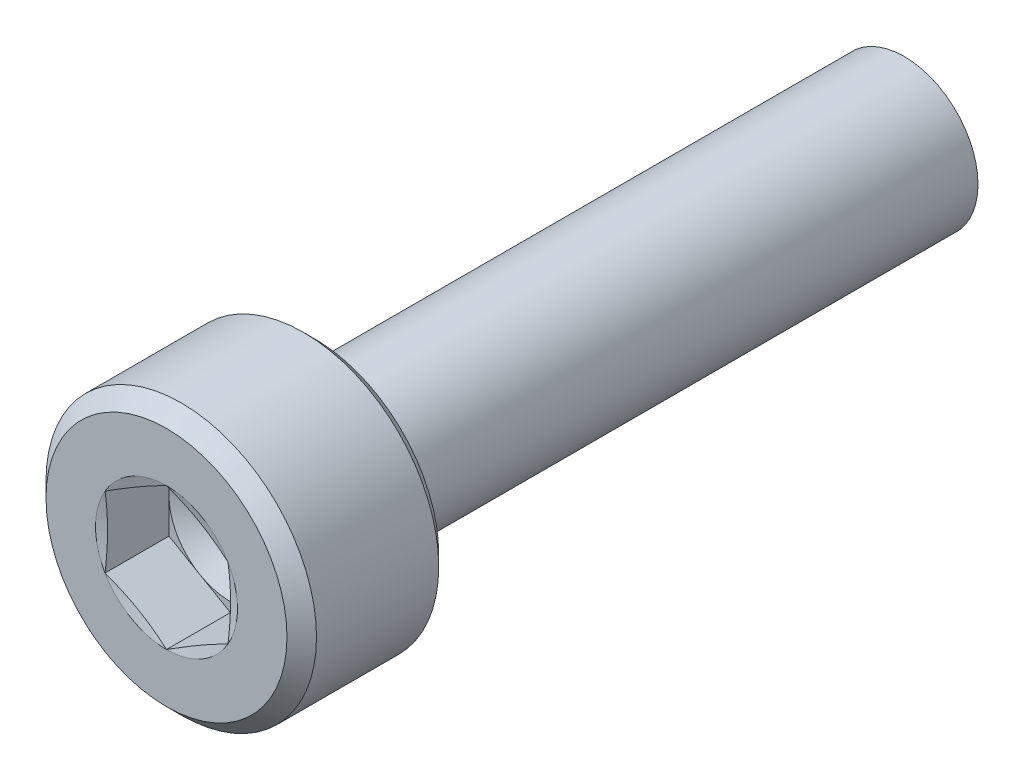
ISO-10303-21;
HEADER;
FILE_DESCRIPTION(('STEP AP214'),'2;1');
FILE_NAME('part.step','',(''),(''),'','','');
FILE_SCHEMA(('AUTOMOTIVE_DESIGN { 1 0 10303 214 1 1 1 1 }'));
ENDSEC;
DATA;
#1=APPLICATION_CONTEXT('core data for automotive mechanical design processes');
#2=APPLICATION_PROTOCOL_DEFINITION('international standard','automotive_design',2000,#1);
#3=PRODUCT_CONTEXT('',#1,'mechanical');
#4=PRODUCT('Part','Part','',(#3));
#5=PRODUCT_RELATED_PRODUCT_CATEGORY('part','',(#4));
#6=PRODUCT_DEFINITION_FORMATION('','',#4);
#7=PRODUCT_DEFINITION_CONTEXT('part definition',#1,'design');
#8=PRODUCT_DEFINITION('design','',#6,#7);
#9=PRODUCT_DEFINITION_SHAPE('','',#8);
#10=(LENGTH_UNIT() NAMED_UNIT(*) SI_UNIT(.MILLI.,.METRE.));
#11=(NAMED_UNIT(*) PLANE_ANGLE_UNIT() SI_UNIT($,.RADIAN.));
#12=(NAMED_UNIT(*) SI_UNIT($,.STERADIAN.) SOLID_ANGLE_UNIT());
#13=UNCERTAINTY_MEASURE_WITH_UNIT(LENGTH_MEASURE(1.E-05),#10,'distance_accuracy_value','');
#14=(GEOMETRIC_REPRESENTATION_CONTEXT(3) GLOBAL_UNCERTAINTY_ASSIGNED_CONTEXT((#13)) GLOBAL_UNIT_ASSIGNED_CONTEXT((#10,
#11,#12)) REPRESENTATION_CONTEXT('',''));
#15=CARTESIAN_POINT('',(0.,0.,0.));
#16=DIRECTION('',(0.,0.,1.));
#17=DIRECTION('',(1.,0.,0.));
#18=AXIS2_PLACEMENT_3D('',#15,#16,#17);
#19=CARTESIAN_POINT('',(1.25,0.721687836487033,-1.3));
#20=DIRECTION('',(0.5,0.866025403784439,0.));
#21=DIRECTION('',(0.,0.,-1.));
#22=AXIS2_PLACEMENT_3D('',#19,#20,#21);
#23=PLANE('',#22);
#24=CARTESIAN_POINT('',(0.,1.44337567297407,0.));
#25=CARTESIAN_POINT('',(0.0266010741574035,1.42801550344856,-0.00411563079121512));
#26=CARTESIAN_POINT('',(0.0532235716252887,1.41263958063488,-0.00803870308418439));
#27=CARTESIAN_POINT('',(0.105990950310015,1.38216656964672,-0.0153837682666469));
#28=CARTESIAN_POINT('',(0.132134938423043,1.36706993862756,-0.0188140917976724));
#29=CARTESIAN_POINT('',(0.184080896535333,1.33708618540438,-0.025174957981675));
#30=CARTESIAN_POINT('',(0.209882172940569,1.32219928511393,-0.0281121725270214));
#31=CARTESIAN_POINT('',(0.261290419336476,1.29254695927157,-0.0334872092687405));
#32=CARTESIAN_POINT('',(0.286897013202713,1.27778166527025,-0.0359293451582305));
#33=CARTESIAN_POINT('',(0.338814014231531,1.24779551622449,-0.0403875802559015));
#34=CARTESIAN_POINT('',(0.365124701320746,1.23257315304511,-0.0423903504078004));
#35=CARTESIAN_POINT('',(0.41739626342825,1.20233457949772,-0.0458161323987716));
#36=CARTESIAN_POINT('',(0.443356722749427,1.18731855544823,-0.0472470738867774));
#37=CARTESIAN_POINT('',(0.495189289691946,1.15738161600266,-0.0495320426407517));
#38=CARTESIAN_POINT('',(0.521061212339776,1.14246059341946,-0.0503888439825338));
#39=CARTESIAN_POINT('',(0.572960169546127,1.112545265764,-0.0515316995489692));
#40=CARTESIAN_POINT('',(0.598987292307348,1.09755099650677,-0.0518146703940937));
#41=CARTESIAN_POINT('',(0.651001958011103,1.06751871961563,-0.0518150403478976));
#42=CARTESIAN_POINT('',(0.676989512865152,1.0524807326171,-0.0515326731292534));
#43=CARTESIAN_POINT('',(0.728831950621195,1.02250093089559,-0.0503906133892446));
#44=CARTESIAN_POINT('',(0.754686839083206,1.00755901473306,-0.049533851076964));
#45=CARTESIAN_POINT('',(0.806530383134818,0.977641594560691,-0.0472488111413174));
#46=CARTESIAN_POINT('',(0.832519038985485,0.962666316501925,-0.0458176006639986));
#47=CARTESIAN_POINT('',(0.88485675257379,0.932508881624223,-0.0423912966395548));
#48=CARTESIAN_POINT('',(0.911205415535616,0.917326964095512,-0.0403881252485901));
#49=CARTESIAN_POINT('',(0.963136866609753,0.88735267068188,-0.035930182334875));
#50=CARTESIAN_POINT('',(0.988721142724691,0.872560833289737,-0.0334890493531678));
#51=CARTESIAN_POINT('',(1.04009703212967,0.842869124815658,-0.028115294806166));
#52=CARTESIAN_POINT('',(1.0658883492984,0.827969535565703,-0.0251782943883381));
#53=CARTESIAN_POINT('',(1.11782834522753,0.797976194945342,-0.0188173828427319));
#54=CARTESIAN_POINT('',(1.14397648287602,0.782882943312323,-0.0153867360503964));
#55=CARTESIAN_POINT('',(1.19675851906724,0.752418637222199,-0.0080404922123379));
#56=CARTESIAN_POINT('',(1.22339156591776,0.737048126643099,-0.00411650230644957));
#57=CARTESIAN_POINT('',(1.25,0.721687836487034,0.));
#58=B_SPLINE_CURVE_WITH_KNOTS('',3,(#24,#25,#26,#27,#28,#29,#30,#31,#32,#33,#34,#35,#36,#37,#38,
#39,#40,#41,#42,#43,#44,#45,#46,#47,#48,#49,#50,#51,#52,#53,#54,#55,#56,#57),.UNSPECIFIED.,.F.,
.F.,(4,2,2,2,2,2,2,2,2,2,2,2,2,2,2,2,4),(0.,0.0929756429984322,0.184124524266457,
0.273918330281164,0.362892504558264,0.454276274812247,0.544344744756976,0.633974830661911,
0.724085265734565,0.814158462912087,0.903775623702066,0.993856267691678,1.0852780295682,
1.17423384973417,1.26402077718908,1.35517544424662,1.44817056877235),.UNSPECIFIED.);
#59=CARTESIAN_POINT('',(0.,1.44337567297406,0.));
#60=VERTEX_POINT('',#59);
#61=CARTESIAN_POINT('',(1.25,0.721687836487034,0.));
#62=VERTEX_POINT('',#61);
#63=EDGE_CURVE('E258',#60,#62,#58,.T.);
#64=ORIENTED_EDGE('',*,*,#63,.F.);
#65=DIRECTION('',(0.,0.,1.));
#66=VECTOR('',#65,1.);
#67=CARTESIAN_POINT('',(0.,1.44337567297406,-1.3));
#68=LINE('',#67,#66);
#69=CARTESIAN_POINT('',(0.,1.44337567297406,-1.3));
#70=VERTEX_POINT('',#69);
#71=EDGE_CURVE('E362',#70,#60,#68,.T.);
#72=ORIENTED_EDGE('',*,*,#71,.F.);
#73=DIRECTION('',(-0.866025403784439,0.5,0.));
#74=VECTOR('',#73,1.);
#75=CARTESIAN_POINT('',(1.25,0.721687836487033,-1.3));
#76=LINE('',#75,#74);
#77=CARTESIAN_POINT('',(0.625,1.08253175473055,-1.3));
#78=VERTEX_POINT('',#77);
#79=EDGE_CURVE('E217',#78,#70,#76,.T.);
#80=ORIENTED_EDGE('',*,*,#79,.F.);
#81=DIRECTION('',(-0.866025403784439,0.5,0.));
#82=VECTOR('',#81,1.);
#83=CARTESIAN_POINT('',(1.25,0.721687836487033,-1.3));
#84=LINE('',#83,#82);
#85=CARTESIAN_POINT('',(1.25,0.721687836487033,-1.3));
#86=VERTEX_POINT('',#85);
#87=EDGE_CURVE('E233',#86,#78,#84,.T.);
#88=ORIENTED_EDGE('',*,*,#87,.F.);
#89=DIRECTION('',(0.,0.,1.));
#90=VECTOR('',#89,1.);
#91=CARTESIAN_POINT('',(1.25,0.721687836487033,-1.3));
#92=LINE('',#91,#90);
#93=EDGE_CURVE('E11',#86,#62,#92,.T.);
#94=ORIENTED_EDGE('',*,*,#93,.T.);
#95=EDGE_LOOP('',(#64,#72,#80,#88,#94));
#96=FACE_BOUND('',#95,.T.);
#97=ADVANCED_FACE('F40',(#96),#23,.F.);
#98=CARTESIAN_POINT('',(1.25,-0.721687836487033,-1.3));
#99=DIRECTION('',(1.,0.,0.));
#100=DIRECTION('',(0.,-1.,0.));
#101=AXIS2_PLACEMENT_3D('',#98,#99,#100);
#102=PLANE('',#101);
#103=CARTESIAN_POINT('',(1.25,0.721687836487034,0.));
#104=CARTESIAN_POINT('',(1.24999823698251,0.690999940764968,-0.0041116921545435));
#105=CARTESIAN_POINT('',(1.24999343638009,0.660285670486277,-0.0080312219209347));
#106=CARTESIAN_POINT('',(1.24998639785537,0.599409952891843,-0.0153701172192225));
#107=CARTESIAN_POINT('',(1.24998411141551,0.569249506080653,-0.0187977996777385));
#108=CARTESIAN_POINT('',(1.24998996305486,0.509329780508077,-0.0251543025812117));
#109=CARTESIAN_POINT('',(1.24999794646817,0.479571212976206,-0.0280897892747288));
#110=CARTESIAN_POINT('',(1.2500223367559,0.420283812845672,-0.0334622466755174));
#111=CARTESIAN_POINT('',(1.25003866580902,0.39075537251126,-0.0359035370987912));
#112=CARTESIAN_POINT('',(1.25002873622066,0.330797047066719,-0.0403659968356117));
#113=CARTESIAN_POINT('',(1.25000121650915,0.300366084889518,-0.0423727707061422));
#114=CARTESIAN_POINT('',(1.2499487716613,0.239913774778711,-0.0458055537624093));
#115=CARTESIAN_POINT('',(1.24992381469335,0.209892884574225,-0.0472395610352221));
#116=CARTESIAN_POINT('',(1.24991464001477,0.149977872401545,-0.0495283234961986));
#117=CARTESIAN_POINT('',(1.24993022107687,0.120083859273445,-0.0503859133498061));
#118=CARTESIAN_POINT('',(1.24996835071472,0.0601265989330451,-0.0515327901252948));
#119=CARTESIAN_POINT('',(1.24999093574578,0.030063293747345,-0.0518190439098863));
#120=CARTESIAN_POINT('',(1.25,0.,-0.0518148554092244));
#121=B_SPLINE_CURVE_WITH_KNOTS('',3,(#103,#104,#105,#106,#107,#108,#109,#110,#111,#112,#113,
#114,#115,#116,#117,#118,#119,#120),.UNSPECIFIED.,.F.,.F.,(4,2,2,2,2,2,2,2,4),(0.,
0.0928866686125054,0.18394754574854,0.273652950549812,0.362536731833363,0.454023240761691,
0.544183383798673,0.633896834523419,0.72408530693755),.UNSPECIFIED.);
#122=CARTESIAN_POINT('',(1.25,0.,-0.0518148554092244));
#123=VERTEX_POINT('',#122);
#124=EDGE_CURVE('E264',#62,#123,#121,.T.);
#125=ORIENTED_EDGE('',*,*,#124,.F.);
#126=ORIENTED_EDGE('',*,*,#93,.F.);
#127=DIRECTION('',(0.,1.,0.));
#128=VECTOR('',#127,1.);
#129=CARTESIAN_POINT('',(1.25,-0.721687836487033,-1.3));
#130=LINE('',#129,#128);
#131=CARTESIAN_POINT('',(1.25,0.,-1.3));
#132=VERTEX_POINT('',#131);
#133=EDGE_CURVE('E237',#132,#86,#130,.T.);
#134=ORIENTED_EDGE('',*,*,#133,.F.);
#135=DIRECTION('',(0.,1.,0.));
#136=VECTOR('',#135,1.);
#137=CARTESIAN_POINT('',(1.25,-0.721687836487033,-1.3));
#138=LINE('',#137,#136);
#139=CARTESIAN_POINT('',(1.25,-0.721687836487033,-1.3));
#140=VERTEX_POINT('',#139);
#141=EDGE_CURVE('E209',#140,#132,#138,.T.);
#142=ORIENTED_EDGE('',*,*,#141,.F.);
#143=DIRECTION('',(0.,0.,1.));
#144=VECTOR('',#143,1.);
#145=CARTESIAN_POINT('',(1.25,-0.721687836487033,-1.3));
#146=LINE('',#145,#144);
#147=CARTESIAN_POINT('',(1.25,-0.721687836487031,0.));
#148=VERTEX_POINT('',#147);
#149=EDGE_CURVE('E54',#140,#148,#146,.T.);
#150=ORIENTED_EDGE('',*,*,#149,.T.);
#151=CARTESIAN_POINT('',(1.25,0.,-0.0518148554092244));
#152=CARTESIAN_POINT('',(1.24999097697891,-0.0300388242332713,-0.0518190278008075));
#153=CARTESIAN_POINT('',(1.24996934760271,-0.0600776555269679,-0.0515329955368294));
#154=CARTESIAN_POINT('',(1.24993379974361,-0.119991561939784,-0.05038720494537));
#155=CARTESIAN_POINT('',(1.24991984260544,-0.149866692950213,-0.0495303717689572));
#156=CARTESIAN_POINT('',(1.24993183671915,-0.209749120653996,-0.0472437357421163));
#157=CARTESIAN_POINT('',(1.24995799405163,-0.239756304838218,-0.0458110022567921));
#158=CARTESIAN_POINT('',(1.25001075989497,-0.300186021092445,-0.0423815066628743));
#159=CARTESIAN_POINT('',(1.25003736932907,-0.330608091422305,-0.040376671117203));
#160=CARTESIAN_POINT('',(1.2500446486428,-0.39057222202749,-0.0359167393057105));
#161=CARTESIAN_POINT('',(1.25002656990743,-0.420115329127233,-0.0334756444191961));
#162=CARTESIAN_POINT('',(1.24999981108288,-0.479432961970562,-0.0281026849191924));
#163=CARTESIAN_POINT('',(1.24999121968782,-0.509207093749055,-0.0251664799491732));
#164=CARTESIAN_POINT('',(1.24998452367544,-0.569159340782016,-0.0188078031597437));
#165=CARTESIAN_POINT('',(1.24998657991599,-0.599336742030467,-0.0153786379059865));
#166=CARTESIAN_POINT('',(1.24999338873797,-0.660248180215888,-0.00803601627135115));
#167=CARTESIAN_POINT('',(1.24999819468793,-0.690981212849153,-0.0041142106816611));
#168=CARTESIAN_POINT('',(1.25,-0.72168783648703,0.));
#169=B_SPLINE_CURVE_WITH_KNOTS('',3,(#151,#152,#153,#154,#155,#156,#157,#158,#159,#160,#161,
#162,#163,#164,#165,#166,#167,#168),.UNSPECIFIED.,.F.,.F.,(4,2,2,2,2,2,2,2,4),(0.,
0.0901150585143207,0.179771826003305,0.26989073371865,0.361350251095626,0.450277827988882,
0.540029901554553,0.631141813166489,0.72408517261877),.UNSPECIFIED.);
#170=EDGE_CURVE('E484',#123,#148,#169,.T.);
#171=ORIENTED_EDGE('',*,*,#170,.F.);
#172=EDGE_LOOP('',(#125,#126,#134,#142,#150,#171));
#173=FACE_BOUND('',#172,.T.);
#174=ADVANCED_FACE('F441',(#173),#102,.F.);
#175=CARTESIAN_POINT('',(0.,-1.44337567297406,-1.3));
#176=DIRECTION('',(0.5,-0.866025403784439,0.));
#177=DIRECTION('',(0.,0.,-1.));
#178=AXIS2_PLACEMENT_3D('',#175,#176,#177);
#179=PLANE('',#178);
#180=CARTESIAN_POINT('',(1.25,-0.72168783648703,0.));
#181=CARTESIAN_POINT('',(1.2233971659058,-0.737044957712528,-0.00411563079121149));
#182=CARTESIAN_POINT('',(1.19676997740861,-0.752412755425053,-0.00803870308417673));
#183=CARTESIAN_POINT('',(1.14399588642073,-0.782874140363045,-0.0153837682666341));
#184=CARTESIAN_POINT('',(1.11784982639007,-0.797967182715585,-0.018814091797658));
#185=CARTESIAN_POINT('',(1.06591015534185,-0.827961825453168,-0.0251749579816608));
#186=CARTESIAN_POINT('',(1.04011708330409,-0.842862936124947,-0.0281121725270084));
#187=CARTESIAN_POINT('',(0.988733292645323,-0.872557620546649,-0.0334872092687323));
#188=CARTESIAN_POINT('',(0.963142876012687,-0.88735093433855,-0.0359293451582256));
#189=CARTESIAN_POINT('',(0.91121560866282,-0.917319301594997,-0.0403875802559157));
#190=CARTESIAN_POINT('',(0.884877311899103,-0.932493843415649,-0.0423903504078287));
#191=CARTESIAN_POINT('',(0.832554157978914,-0.962643057322603,-0.0458161323988174));
#192=CARTESIAN_POINT('',(0.806569670027579,-0.977617462563912,-0.0472470738868286));
#193=CARTESIAN_POINT('',(0.754727236484892,-1.00753731255668,-0.0495320426408034));
#194=CARTESIAN_POINT('',(0.728869290553528,-1.02248254352281,-0.0503888439825823));
#195=CARTESIAN_POINT('',(0.677012378238376,-1.05247069506564,-0.0515316995489991));
#196=CARTESIAN_POINT('',(0.651013398769965,-1.06751370993562,-0.0518146703941098));
#197=CARTESIAN_POINT('',(0.598997351197246,-1.09754359335878,-0.051815040347882));
#198=CARTESIAN_POINT('',(0.57298029500795,-1.11253048254531,-0.0515326731292214));
#199=CARTESIAN_POINT('',(0.521095806239011,-1.14243744977536,-0.0503906133891943));
#200=CARTESIAN_POINT('',(0.495228283030122,-1.15735748191422,-0.0495338510769088));
#201=CARTESIAN_POINT('',(0.443397265119366,-1.18729659799899,-0.0472488111412611));
#202=CARTESIAN_POINT('',(0.417433965966339,-1.20231579514653,-0.0458176006639436));
#203=CARTESIAN_POINT('',(0.365148004454804,-1.2325628672512,-0.0423912966395229));
#204=CARTESIAN_POINT('',(0.338825746715614,-1.24779051996754,-0.0403881252485777));
#205=CARTESIAN_POINT('',(0.28690152162188,-1.27777732914604,-0.0359301823349323));
#206=CARTESIAN_POINT('',(0.261299276614448,-1.29253804350266,-0.0334890493532856));
#207=CARTESIAN_POINT('',(0.209897558092061,-1.32218501463202,-0.0281152948063626));
#208=CARTESIAN_POINT('',(0.184098476711416,-1.33707115587218,-0.025178294388549));
#209=CARTESIAN_POINT('',(0.13215348382532,-1.36705584150914,-0.0188173828429405));
#210=CARTESIAN_POINT('',(0.106008275661093,-1.38215416715798,-0.0153867360505843));
#211=CARTESIAN_POINT('',(0.0532343945823571,-1.41263259831833,-0.00804049221245096));
#212=CARTESIAN_POINT('',(0.0266066185261265,-1.42801223818175,-0.00411650230650442));
#213=CARTESIAN_POINT('',(0.,-1.44337567297406,0.));
#214=B_SPLINE_CURVE_WITH_KNOTS('',3,(#180,#181,#182,#183,#184,#185,#186,#187,#188,#189,#190,
#191,#192,#193,#194,#195,#196,#197,#198,#199,#200,#201,#202,#203,#204,#205,#206,#207,#208,#209,
#210,#211,#212,#213),.UNSPECIFIED.,.F.,.F.,(4,2,2,2,2,2,2,2,2,2,2,2,2,2,2,2,4),(0.,
0.0929756429983488,0.18412452426635,0.273918330281088,0.362892504558272,0.454276274812701,
0.544344744757564,0.633974830662343,0.72408526573457,0.814158462911407,0.903775623701171,
0.993856267691015,1.0852780295682,1.17423384973301,1.26402077718748,1.3551754442454,
1.44817056877235),.UNSPECIFIED.);
#215=CARTESIAN_POINT('',(0.,-1.44337567297406,0.));
#216=VERTEX_POINT('',#215);
#217=EDGE_CURVE('E426',#148,#216,#214,.T.);
#218=ORIENTED_EDGE('',*,*,#217,.F.);
#219=ORIENTED_EDGE('',*,*,#149,.F.);
#220=DIRECTION('',(0.866025403784439,0.5,0.));
#221=VECTOR('',#220,1.);
#222=CARTESIAN_POINT('',(0.,-1.44337567297406,-1.3));
#223=LINE('',#222,#221);
#224=CARTESIAN_POINT('',(0.625,-1.08253175473055,-1.3));
#225=VERTEX_POINT('',#224);
#226=EDGE_CURVE('E212',#225,#140,#223,.T.);
#227=ORIENTED_EDGE('',*,*,#226,.F.);
#228=DIRECTION('',(0.866025403784439,0.5,0.));
#229=VECTOR('',#228,1.);
#230=CARTESIAN_POINT('',(0.,-1.44337567297406,-1.3));
#231=LINE('',#230,#229);
#232=CARTESIAN_POINT('',(0.,-1.44337567297406,-1.3));
#233=VERTEX_POINT('',#232);
#234=EDGE_CURVE('E200',#233,#225,#231,.T.);
#235=ORIENTED_EDGE('',*,*,#234,.F.);
#236=DIRECTION('',(0.,0.,1.));
#237=VECTOR('',#236,1.);
#238=CARTESIAN_POINT('',(0.,-1.44337567297406,-1.3));
#239=LINE('',#238,#237);
#240=EDGE_CURVE('E361',#233,#216,#239,.T.);
#241=ORIENTED_EDGE('',*,*,#240,.T.);
#242=EDGE_LOOP('',(#218,#219,#227,#235,#241));
#243=FACE_BOUND('',#242,.T.);
#244=ADVANCED_FACE('F432',(#243),#179,.F.);
#245=CARTESIAN_POINT('',(-1.25,-0.721687836487032,-1.3));
#246=DIRECTION('',(-0.5,-0.866025403784439,0.));
#247=DIRECTION('',(-0.866025403784439,0.5,0.));
#248=AXIS2_PLACEMENT_3D('',#245,#246,#247);
#249=PLANE('',#248);
#250=CARTESIAN_POINT('',(0.,-1.44337567297406,0.));
#251=CARTESIAN_POINT('',(-0.0266010741573072,-1.42801550344862,-0.00411563079120053));
#252=CARTESIAN_POINT('',(-0.0532235716251028,-1.412639580635,-0.00803870308415418));
#253=CARTESIAN_POINT('',(-0.105990950309719,-1.38216656964693,-0.0153837682665966));
#254=CARTESIAN_POINT('',(-0.132134938422726,-1.3670699386278,-0.0188140917976166));
#255=CARTESIAN_POINT('',(-0.184080896535033,-1.33708618540464,-0.0251749579816186));
#256=CARTESIAN_POINT('',(-0.209882172940307,-1.32219928511417,-0.0281121725269688));
#257=CARTESIAN_POINT('',(-0.261290419336326,-1.29254695927172,-0.0334872092687093));
#258=CARTESIAN_POINT('',(-0.286897013202638,-1.27778166527032,-0.0359293451582158));
#259=CARTESIAN_POINT('',(-0.338814014231424,-1.24779551622451,-0.0403875802559013));
#260=CARTESIAN_POINT('',(-0.365124701320532,-1.23257315304517,-0.0423903504078018));
#261=CARTESIAN_POINT('',(-0.417396263427902,-1.20233457949783,-0.0458161323987747));
#262=CARTESIAN_POINT('',(-0.443356722749052,-1.18731855544836,-0.0472470738867794));
#263=CARTESIAN_POINT('',(-0.495189289691583,-1.15738161600281,-0.0495320426407528));
#264=CARTESIAN_POINT('',(-0.521061212339452,-1.14246059341961,-0.0503888439825337));
#265=CARTESIAN_POINT('',(-0.572960169545936,-1.11254526576409,-0.0515316995489712));
#266=CARTESIAN_POINT('',(-0.59898729230725,-1.09755099650681,-0.0518146703940977));
#267=CARTESIAN_POINT('',(-0.651001958010772,-1.06751871961583,-0.0518150403478942));
#268=CARTESIAN_POINT('',(-0.676989512864494,-1.05248073261752,-0.0515326731292499));
#269=CARTESIAN_POINT('',(-0.728831950620127,-1.02250093089636,-0.0503906133892435));
#270=CARTESIAN_POINT('',(-0.754686839082053,-1.00755901473394,-0.0495338510769603));
#271=CARTESIAN_POINT('',(-0.806530383133706,-0.97764159456164,-0.0472488111413116));
#272=CARTESIAN_POINT('',(-0.832519038984498,-0.962666316502832,-0.0458176006639886));
#273=CARTESIAN_POINT('',(-0.884856752573216,-0.932508881624801,-0.0423912966395508));
#274=CARTESIAN_POINT('',(-0.911205415535328,-0.917326964095802,-0.0403881252485919));
#275=CARTESIAN_POINT('',(-0.963136866609371,-0.887352670681979,-0.0359301823349303));
#276=CARTESIAN_POINT('',(-0.98872114272393,-0.872560833289935,-0.0334890493532837));
#277=CARTESIAN_POINT('',(-1.04009703212842,-0.842869124816045,-0.0281152948063605));
#278=CARTESIAN_POINT('',(-1.06588834929704,-0.827969535566183,-0.0251782943885465));
#279=CARTESIAN_POINT('',(-1.11782834522619,-0.797976194945903,-0.0188173828429378));
#280=CARTESIAN_POINT('',(-1.1439764828748,-0.782882943312871,-0.0153867360505819));
#281=CARTESIAN_POINT('',(-1.19675851906652,-0.752418637222568,-0.00804049221244955));
#282=CARTESIAN_POINT('',(-1.22339156591741,-0.7370481266433,-0.00411650230650377));
#283=CARTESIAN_POINT('',(-1.25,-0.721687836487036,0.));
#284=B_SPLINE_CURVE_WITH_KNOTS('',3,(#250,#251,#252,#253,#254,#255,#256,#257,#258,#259,#260,
#261,#262,#263,#264,#265,#266,#267,#268,#269,#270,#271,#272,#273,#274,#275,#276,#277,#278,#279,
#280,#281,#282,#283),.UNSPECIFIED.,.F.,.F.,(4,2,2,2,2,2,2,2,2,2,2,2,2,2,2,2,4),(0.,
0.0929756429981014,0.184124524266029,0.273918330280853,0.362892504558266,0.454276274811929,
0.544344744756552,0.633974830661595,0.724085265734569,0.814158462910913,0.9037756237005,
0.993856267690502,1.0852780295682,1.17423384973303,1.2640207771875,1.35517544424541,
1.44817056877234),.UNSPECIFIED.);
#285=CARTESIAN_POINT('',(-1.25,-0.721687836487033,0.));
#286=VERTEX_POINT('',#285);
#287=EDGE_CURVE('E348',#216,#286,#284,.T.);
#288=ORIENTED_EDGE('',*,*,#287,.F.);
#289=ORIENTED_EDGE('',*,*,#240,.F.);
#290=DIRECTION('',(0.866025403784439,-0.5,0.));
#291=VECTOR('',#290,1.);
#292=CARTESIAN_POINT('',(-1.25,-0.721687836487032,-1.3));
#293=LINE('',#292,#291);
#294=CARTESIAN_POINT('',(-0.625,-1.08253175473055,-1.3));
#295=VERTEX_POINT('',#294);
#296=EDGE_CURVE('E185',#295,#233,#293,.T.);
#297=ORIENTED_EDGE('',*,*,#296,.F.);
#298=DIRECTION('',(0.866025403784439,-0.5,0.));
#299=VECTOR('',#298,1.);
#300=CARTESIAN_POINT('',(-1.25,-0.721687836487032,-1.3));
#301=LINE('',#300,#299);
#302=CARTESIAN_POINT('',(-1.25,-0.721687836487032,-1.3));
#303=VERTEX_POINT('',#302);
#304=EDGE_CURVE('E199',#303,#295,#301,.T.);
#305=ORIENTED_EDGE('',*,*,#304,.F.);
#306=DIRECTION('',(0.,0.,1.));
#307=VECTOR('',#306,1.);
#308=CARTESIAN_POINT('',(-1.25,-0.721687836487032,-1.3));
#309=LINE('',#308,#307);
#310=EDGE_CURVE('E353',#303,#286,#309,.T.);
#311=ORIENTED_EDGE('',*,*,#310,.T.);
#312=EDGE_LOOP('',(#288,#289,#297,#305,#311));
#313=FACE_BOUND('',#312,.T.);
#314=ADVANCED_FACE('F330',(#313),#249,.F.);
#315=CARTESIAN_POINT('',(-1.25,0.721687836487033,-1.3));
#316=DIRECTION('',(-1.,0.,0.));
#317=DIRECTION('',(0.,0.,1.));
#318=AXIS2_PLACEMENT_3D('',#315,#316,#317);
#319=PLANE('',#318);
#320=CARTESIAN_POINT('',(-1.25,-0.721687836487036,0.));
#321=CARTESIAN_POINT('',(-1.24999821886412,-0.690932210000902,-0.00412077366792503));
#322=CARTESIAN_POINT('',(-1.24999387857277,-0.660150074866336,-0.00804841753616333));
#323=CARTESIAN_POINT('',(-1.24998827175687,-0.599138517352571,-0.0154014380852009));
#324=CARTESIAN_POINT('',(-1.24998694660483,-0.568910098118886,-0.0188351562390941));
#325=CARTESIAN_POINT('',(-1.24999480562822,-0.508853302588297,-0.0252016317976271));
#326=CARTESIAN_POINT('',(-1.25000383433192,-0.479025637483938,-0.0281410598390331));
#327=CARTESIAN_POINT('',(-1.25002969465079,-0.419597741693308,-0.0335193354014606));
#328=CARTESIAN_POINT('',(-1.25004645478338,-0.389997900664602,-0.0359624795469015));
#329=CARTESIAN_POINT('',(-1.25003624698015,-0.329932451723906,-0.0404235084844104));
#330=CARTESIAN_POINT('',(-1.25000804135667,-0.299465811483142,-0.0424275685535516));
#331=CARTESIAN_POINT('',(-1.24995480282112,-0.238942721030509,-0.0458531334643784));
#332=CARTESIAN_POINT('',(-1.24992972983623,-0.208886728419523,-0.0472826637209089));
#333=CARTESIAN_POINT('',(-1.24991813207592,-0.148900847883205,-0.0495620346762597));
#334=CARTESIAN_POINT('',(-1.24993141807717,-0.11897106783738,-0.0504146953997261));
#335=CARTESIAN_POINT('',(-1.24997269319909,-0.0589403752630816,-0.0515465360951228));
#336=CARTESIAN_POINT('',(-1.25000076068601,-0.0288394047107543,-0.0518226201453485));
#337=CARTESIAN_POINT('',(-1.24999924183589,0.0312625879908033,-0.051806775859687));
#338=CARTESIAN_POINT('',(-1.24996984632998,0.0612636106529509,-0.051516727619696));
#339=CARTESIAN_POINT('',(-1.24992780073287,0.121103798973637,-0.0503604178239));
#340=CARTESIAN_POINT('',(-1.24991506723406,0.150943020383787,-0.049497059210113));
#341=CARTESIAN_POINT('',(-1.24992723273208,0.21075428356878,-0.0471998946158216));
#342=CARTESIAN_POINT('',(-1.2499523271874,0.240726211851809,-0.0457631542002465));
#343=CARTESIAN_POINT('',(-1.25000360417568,0.301084835090529,-0.0423268298904389));
#344=CARTESIAN_POINT('',(-1.25002979734107,0.331471068197909,-0.0403191918787037));
#345=CARTESIAN_POINT('',(-1.25003699758531,0.391328089389752,-0.0358577918245045));
#346=CARTESIAN_POINT('',(-1.25001928795661,0.42079996858613,-0.0334185904444356));
#347=CARTESIAN_POINT('',(-1.24999394681244,0.479977430952503,-0.0280514827152005));
#348=CARTESIAN_POINT('',(-1.24998641124457,0.509682617587425,-0.0251192130216116));
#349=CARTESIAN_POINT('',(-1.24998172156504,0.569498085241384,-0.0187704983671833));
#350=CARTESIAN_POINT('',(-1.24998472717054,0.599607652246593,-0.0153473647873735));
#351=CARTESIAN_POINT('',(-1.2499929474011,0.660383517909659,-0.00801885284655767));
#352=CARTESIAN_POINT('',(-1.24999820530047,0.691048814920108,-0.00410514993995136));
#353=CARTESIAN_POINT('',(-1.25,0.721687836487032,0.));
#354=B_SPLINE_CURVE_WITH_KNOTS('',3,(#320,#321,#322,#323,#324,#325,#326,#327,#328,#329,#330,
#331,#332,#333,#334,#335,#336,#337,#338,#339,#340,#341,#342,#343,#344,#345,#346,#347,#348,#349,
#350,#351,#352,#353),.UNSPECIFIED.,.F.,.F.,(4,2,2,2,2,2,2,2,2,2,2,2,2,2,2,2,4),(0.,
0.0930916808948182,0.184357193016995,0.274270023536689,0.363367712388216,0.454960459263653,
0.545225160616974,0.635045351768193,0.725346604253175,0.815348481166214,0.904898075925872,
0.994911965590393,1.0862647637543,1.17497894838529,1.26452405113569,1.35543174170835,
1.44817047837161),.UNSPECIFIED.);
#355=CARTESIAN_POINT('',(-1.25,0.721687836487033,0.));
#356=VERTEX_POINT('',#355);
#357=EDGE_CURVE('E376',#286,#356,#354,.T.);
#358=ORIENTED_EDGE('',*,*,#357,.F.);
#359=ORIENTED_EDGE('',*,*,#310,.F.);
#360=DIRECTION('',(0.,-1.,0.));
#361=VECTOR('',#360,1.);
#362=CARTESIAN_POINT('',(-1.25,0.721687836487033,-1.3));
#363=LINE('',#362,#361);
#364=CARTESIAN_POINT('',(-1.25,0.,-1.3));
#365=VERTEX_POINT('',#364);
#366=EDGE_CURVE('E195',#365,#303,#363,.T.);
#367=ORIENTED_EDGE('',*,*,#366,.F.);
#368=DIRECTION('',(0.,-1.,0.));
#369=VECTOR('',#368,1.);
#370=CARTESIAN_POINT('',(-1.25,0.721687836487033,-1.3));
#371=LINE('',#370,#369);
#372=CARTESIAN_POINT('',(-1.25,0.721687836487033,-1.3));
#373=VERTEX_POINT('',#372);
#374=EDGE_CURVE('E191',#373,#365,#371,.T.);
#375=ORIENTED_EDGE('',*,*,#374,.F.);
#376=DIRECTION('',(0.,0.,1.));
#377=VECTOR('',#376,1.);
#378=CARTESIAN_POINT('',(-1.25,0.721687836487033,-1.3));
#379=LINE('',#378,#377);
#380=EDGE_CURVE('E67',#373,#356,#379,.T.);
#381=ORIENTED_EDGE('',*,*,#380,.T.);
#382=EDGE_LOOP('',(#358,#359,#367,#375,#381));
#383=FACE_BOUND('',#382,.T.);
#384=ADVANCED_FACE('F392',(#383),#319,.F.);
#385=CARTESIAN_POINT('',(0.,1.44337567297406,-1.3));
#386=DIRECTION('',(-0.5,0.866025403784439,0.));
#387=DIRECTION('',(0.,0.,1.));
#388=AXIS2_PLACEMENT_3D('',#385,#386,#387);
#389=PLANE('',#388);
#390=CARTESIAN_POINT('',(-1.25,0.721687836487032,0.));
#391=CARTESIAN_POINT('',(-1.22339716590584,0.737044957712511,-0.00411563079120637));
#392=CARTESIAN_POINT('',(-1.19676997740868,0.752412755425021,-0.00803870308416613));
#393=CARTESIAN_POINT('',(-1.14399588642084,0.782874140362995,-0.0153837682666164));
#394=CARTESIAN_POINT('',(-1.1178498263902,0.797967182715534,-0.0188140917976384));
#395=CARTESIAN_POINT('',(-1.06591015534198,0.827961825453124,-0.0251749579816409));
#396=CARTESIAN_POINT('',(-1.04011708330421,0.842862936124911,-0.0281121725269898));
#397=CARTESIAN_POINT('',(-0.988733292645396,0.87255762054663,-0.0334872092687212));
#398=CARTESIAN_POINT('',(-0.963142876012725,0.887350934338539,-0.0359293451582203));
#399=CARTESIAN_POINT('',(-0.911215608662851,0.917319301594967,-0.0403875802559155));
#400=CARTESIAN_POINT('',(-0.884877311899161,0.932493843415591,-0.042390350407829));
#401=CARTESIAN_POINT('',(-0.832554157979012,0.962643057322515,-0.0458161323988182));
#402=CARTESIAN_POINT('',(-0.806569670027688,0.97761746256382,-0.0472470738868289));
#403=CARTESIAN_POINT('',(-0.754727236485004,1.00753731255659,-0.0495320426408036));
#404=CARTESIAN_POINT('',(-0.728869290553631,1.02248254352274,-0.0503888439825824));
#405=CARTESIAN_POINT('',(-0.677012378238439,1.0524706950656,-0.0515316995489988));
#406=CARTESIAN_POINT('',(-0.651013398769998,1.06751370993561,-0.0518146703941088));
#407=CARTESIAN_POINT('',(-0.598997351197131,1.09754359335884,-0.0518150403478823));
#408=CARTESIAN_POINT('',(-0.572980295007719,1.11253048254543,-0.0515326731292221));
#409=CARTESIAN_POINT('',(-0.521095806238615,1.14243744977554,-0.0503906133891946));
#410=CARTESIAN_POINT('',(-0.49522828302968,1.1573574819144,-0.0495338510769098));
#411=CARTESIAN_POINT('',(-0.443397265118909,1.18729659799915,-0.0472488111412628));
#412=CARTESIAN_POINT('',(-0.417433965965914,1.20231579514667,-0.0458176006639467));
#413=CARTESIAN_POINT('',(-0.365148004454539,1.23256286725127,-0.042391296639524));
#414=CARTESIAN_POINT('',(-0.338825746715477,1.24779051996758,-0.0403881252485769));
#415=CARTESIAN_POINT('',(-0.286901521621781,1.27777732914614,-0.0359301823349139));
#416=CARTESIAN_POINT('',(-0.261299276614258,1.29253804350285,-0.0334890493532472));
#417=CARTESIAN_POINT('',(-0.209897558091737,1.32218501463232,-0.0281152948062984));
#418=CARTESIAN_POINT('',(-0.184098476711047,1.33707115587249,-0.0251782943884803));
#419=CARTESIAN_POINT('',(-0.132153483824933,1.36705584150943,-0.0188173828428726));
#420=CARTESIAN_POINT('',(-0.106008275660732,1.38215416715824,-0.0153867360505231));
#421=CARTESIAN_POINT('',(-0.0532343945821315,1.41263259831848,-0.00804049221241403));
#422=CARTESIAN_POINT('',(-0.0266066185260098,1.42801223818181,-0.00411650230648636));
#423=CARTESIAN_POINT('',(0.,1.44337567297407,0.));
#424=B_SPLINE_CURVE_WITH_KNOTS('',3,(#390,#391,#392,#393,#394,#395,#396,#397,#398,#399,#400,
#401,#402,#403,#404,#405,#406,#407,#408,#409,#410,#411,#412,#413,#414,#415,#416,#417,#418,#419,
#420,#421,#422,#423),.UNSPECIFIED.,.F.,.F.,(4,2,2,2,2,2,2,2,2,2,2,2,2,2,2,2,4),(0.,
0.0929756429982334,0.1841245242662,0.273918330280977,0.362892504558266,0.454276274812582,
0.54434474475741,0.633974830662229,0.72408526573457,0.814158462911794,0.903775623701688,
0.993856267691406,1.08527802956821,1.17423384973339,1.264020777188,1.3551754442458,
1.44817056877235),.UNSPECIFIED.);
#425=EDGE_CURVE('E469',#356,#60,#424,.T.);
#426=ORIENTED_EDGE('',*,*,#425,.F.);
#427=ORIENTED_EDGE('',*,*,#380,.F.);
#428=DIRECTION('',(-0.866025403784439,-0.5,0.));
#429=VECTOR('',#428,1.);
#430=CARTESIAN_POINT('',(0.,1.44337567297406,-1.3));
#431=LINE('',#430,#429);
#432=CARTESIAN_POINT('',(-0.625,1.08253175473055,-1.3));
#433=VERTEX_POINT('',#432);
#434=EDGE_CURVE('E194',#433,#373,#431,.T.);
#435=ORIENTED_EDGE('',*,*,#434,.F.);
#436=DIRECTION('',(-0.866025403784439,-0.5,0.));
#437=VECTOR('',#436,1.);
#438=CARTESIAN_POINT('',(0.,1.44337567297406,-1.3));
#439=LINE('',#438,#437);
#440=EDGE_CURVE('E213',#70,#433,#439,.T.);
#441=ORIENTED_EDGE('',*,*,#440,.F.);
#442=ORIENTED_EDGE('',*,*,#71,.T.);
#443=EDGE_LOOP('',(#426,#427,#435,#441,#442));
#444=FACE_BOUND('',#443,.T.);
#445=ADVANCED_FACE('F315',(#444),#389,.F.);
#446=CARTESIAN_POINT('',(0.,0.,-1.3));
#447=DIRECTION('',(0.,0.,1.));
#448=DIRECTION('',(1.,0.,0.));
#449=AXIS2_PLACEMENT_3D('',#446,#447,#448);
#450=PLANE('',#449);
#451=CARTESIAN_POINT('',(0.,0.,-1.3));
#452=DIRECTION('',(0.,0.,1.));
#453=DIRECTION('',(1.,0.,0.));
#454=AXIS2_PLACEMENT_3D('',#451,#452,#453);
#455=CIRCLE('',#454,1.25);
#456=EDGE_CURVE('E228',#433,#365,#455,.T.);
#457=ORIENTED_EDGE('',*,*,#456,.F.);
#458=ORIENTED_EDGE('',*,*,#434,.T.);
#459=ORIENTED_EDGE('',*,*,#374,.T.);
#460=EDGE_LOOP('',(#457,#458,#459));
#461=FACE_BOUND('',#460,.T.);
#462=ADVANCED_FACE('F311',(#461),#450,.T.);
#463=CARTESIAN_POINT('',(0.,0.,-1.3));
#464=DIRECTION('',(0.,0.,1.));
#465=DIRECTION('',(1.,0.,0.));
#466=AXIS2_PLACEMENT_3D('',#463,#464,#465);
#467=PLANE('',#466);
#468=CARTESIAN_POINT('',(0.,0.,-1.3));
#469=DIRECTION('',(0.,0.,1.));
#470=DIRECTION('',(1.,0.,0.));
#471=AXIS2_PLACEMENT_3D('',#468,#469,#470);
#472=CIRCLE('',#471,1.25);
#473=EDGE_CURVE('E205',#78,#433,#472,.T.);
#474=ORIENTED_EDGE('',*,*,#473,.F.);
#475=ORIENTED_EDGE('',*,*,#79,.T.);
#476=ORIENTED_EDGE('',*,*,#440,.T.);
#477=EDGE_LOOP('',(#474,#475,#476));
#478=FACE_BOUND('',#477,.T.);
#479=ADVANCED_FACE('F307',(#478),#467,.T.);
#480=CARTESIAN_POINT('',(0.,0.,-1.3));
#481=DIRECTION('',(0.,0.,1.));
#482=DIRECTION('',(1.,0.,0.));
#483=AXIS2_PLACEMENT_3D('',#480,#481,#482);
#484=PLANE('',#483);
#485=CARTESIAN_POINT('',(0.,0.,-1.3));
#486=DIRECTION('',(0.,0.,1.));
#487=DIRECTION('',(1.,0.,0.));
#488=AXIS2_PLACEMENT_3D('',#485,#486,#487);
#489=CIRCLE('',#488,1.25);
#490=EDGE_CURVE('E222',#365,#295,#489,.T.);
#491=ORIENTED_EDGE('',*,*,#490,.F.);
#492=ORIENTED_EDGE('',*,*,#366,.T.);
#493=ORIENTED_EDGE('',*,*,#304,.T.);
#494=EDGE_LOOP('',(#491,#492,#493));
#495=FACE_BOUND('',#494,.T.);
#496=ADVANCED_FACE('F310',(#495),#484,.T.);
#497=CARTESIAN_POINT('',(0.,0.,-1.3));
#498=DIRECTION('',(0.,0.,1.));
#499=DIRECTION('',(1.,0.,0.));
#500=AXIS2_PLACEMENT_3D('',#497,#498,#499);
#501=PLANE('',#500);
#502=CARTESIAN_POINT('',(0.,0.,-1.3));
#503=DIRECTION('',(0.,0.,1.));
#504=DIRECTION('',(1.,0.,0.));
#505=AXIS2_PLACEMENT_3D('',#502,#503,#504);
#506=CIRCLE('',#505,1.25);
#507=EDGE_CURVE('E218',#295,#225,#506,.T.);
#508=ORIENTED_EDGE('',*,*,#507,.F.);
#509=ORIENTED_EDGE('',*,*,#296,.T.);
#510=ORIENTED_EDGE('',*,*,#234,.T.);
#511=EDGE_LOOP('',(#508,#509,#510));
#512=FACE_BOUND('',#511,.T.);
#513=ADVANCED_FACE('F320',(#512),#501,.T.);
#514=CARTESIAN_POINT('',(0.,0.,-1.3));
#515=DIRECTION('',(0.,0.,1.));
#516=DIRECTION('',(1.,0.,0.));
#517=AXIS2_PLACEMENT_3D('',#514,#515,#516);
#518=PLANE('',#517);
#519=CARTESIAN_POINT('',(0.,0.,-1.3));
#520=DIRECTION('',(0.,0.,1.));
#521=DIRECTION('',(1.,0.,0.));
#522=AXIS2_PLACEMENT_3D('',#519,#520,#521);
#523=CIRCLE('',#522,1.25);
#524=EDGE_CURVE('E206',#225,#132,#523,.T.);
#525=ORIENTED_EDGE('',*,*,#524,.F.);
#526=ORIENTED_EDGE('',*,*,#226,.T.);
#527=ORIENTED_EDGE('',*,*,#141,.T.);
#528=EDGE_LOOP('',(#525,#526,#527));
#529=FACE_BOUND('',#528,.T.);
#530=ADVANCED_FACE('F317',(#529),#518,.T.);
#531=CARTESIAN_POINT('',(0.,0.,-1.3));
#532=DIRECTION('',(0.,0.,1.));
#533=DIRECTION('',(1.,0.,0.));
#534=AXIS2_PLACEMENT_3D('',#531,#532,#533);
#535=PLANE('',#534);
#536=CARTESIAN_POINT('',(0.,0.,-1.3));
#537=DIRECTION('',(0.,0.,1.));
#538=DIRECTION('',(1.,0.,0.));
#539=AXIS2_PLACEMENT_3D('',#536,#537,#538);
#540=CIRCLE('',#539,1.25);
#541=EDGE_CURVE('E201',#132,#78,#540,.T.);
#542=ORIENTED_EDGE('',*,*,#541,.F.);
#543=ORIENTED_EDGE('',*,*,#133,.T.);
#544=ORIENTED_EDGE('',*,*,#87,.T.);
#545=EDGE_LOOP('',(#542,#543,#544));
#546=FACE_BOUND('',#545,.T.);
#547=ADVANCED_FACE('F288',(#546),#535,.T.);
#548=CARTESIAN_POINT('',(0.,0.,-0.0518148554092243));
#549=DIRECTION('',(0.,0.,1.));
#550=DIRECTION('',(1.,0.,0.));
#551=AXIS2_PLACEMENT_3D('',#548,#549,#550);
#552=CONICAL_SURFACE('',#551,1.25,1.30899693899575);
#553=ORIENTED_EDGE('',*,*,#63,.T.);
#554=CARTESIAN_POINT('',(0.,0.,0.));
#555=DIRECTION('',(0.,0.,1.));
#556=DIRECTION('',(1.,0.,0.));
#557=AXIS2_PLACEMENT_3D('',#554,#555,#556);
#558=CIRCLE('',#557,1.44337567297406);
#559=EDGE_CURVE('E531',#62,#60,#558,.T.);
#560=ORIENTED_EDGE('',*,*,#559,.T.);
#561=EDGE_LOOP('',(#553,#560));
#562=FACE_BOUND('',#561,.T.);
#563=ADVANCED_FACE('F277',(#562),#552,.F.);
#564=CARTESIAN_POINT('',(0.,0.,-0.0518148554092243));
#565=DIRECTION('',(0.,0.,1.));
#566=DIRECTION('',(1.,0.,0.));
#567=AXIS2_PLACEMENT_3D('',#564,#565,#566);
#568=CONICAL_SURFACE('',#567,1.25,1.30899693899575);
#569=ORIENTED_EDGE('',*,*,#217,.T.);
#570=CARTESIAN_POINT('',(0.,0.,0.));
#571=DIRECTION('',(0.,0.,1.));
#572=DIRECTION('',(1.,0.,0.));
#573=AXIS2_PLACEMENT_3D('',#570,#571,#572);
#574=CIRCLE('',#573,1.44337567297406);
#575=EDGE_CURVE('E536',#216,#148,#574,.T.);
#576=ORIENTED_EDGE('',*,*,#575,.T.);
#577=EDGE_LOOP('',(#569,#576));
#578=FACE_BOUND('',#577,.T.);
#579=ADVANCED_FACE('F287',(#578),#568,.F.);
#580=CARTESIAN_POINT('',(0.,0.,-0.0518148554092243));
#581=DIRECTION('',(0.,0.,1.));
#582=DIRECTION('',(1.,0.,0.));
#583=AXIS2_PLACEMENT_3D('',#580,#581,#582);
#584=CONICAL_SURFACE('',#583,1.25,1.30899693899575);
#585=ORIENTED_EDGE('',*,*,#287,.T.);
#586=CARTESIAN_POINT('',(0.,0.,0.));
#587=DIRECTION('',(0.,0.,1.));
#588=DIRECTION('',(1.,0.,0.));
#589=AXIS2_PLACEMENT_3D('',#586,#587,#588);
#590=CIRCLE('',#589,1.44337567297406);
#591=EDGE_CURVE('E252',#286,#216,#590,.T.);
#592=ORIENTED_EDGE('',*,*,#591,.T.);
#593=EDGE_LOOP('',(#585,#592));
#594=FACE_BOUND('',#593,.T.);
#595=ADVANCED_FACE('F325',(#594),#584,.F.);
#596=CARTESIAN_POINT('',(0.,0.,-0.0518148554092243));
#597=DIRECTION('',(0.,0.,1.));
#598=DIRECTION('',(1.,0.,0.));
#599=AXIS2_PLACEMENT_3D('',#596,#597,#598);
#600=CONICAL_SURFACE('',#599,1.25,1.30899693899575);
#601=ORIENTED_EDGE('',*,*,#357,.T.);
#602=CARTESIAN_POINT('',(0.,0.,0.));
#603=DIRECTION('',(0.,0.,1.));
#604=DIRECTION('',(1.,0.,0.));
#605=AXIS2_PLACEMENT_3D('',#602,#603,#604);
#606=CIRCLE('',#605,1.44337567297406);
#607=EDGE_CURVE('E365',#356,#286,#606,.T.);
#608=ORIENTED_EDGE('',*,*,#607,.T.);
#609=EDGE_LOOP('',(#601,#608));
#610=FACE_BOUND('',#609,.T.);
#611=ADVANCED_FACE('F42',(#610),#600,.F.);
#612=CARTESIAN_POINT('',(0.,0.,-0.0518148554092243));
#613=DIRECTION('',(0.,0.,1.));
#614=DIRECTION('',(1.,0.,0.));
#615=AXIS2_PLACEMENT_3D('',#612,#613,#614);
#616=CONICAL_SURFACE('',#615,1.25,1.30899693899575);
#617=CARTESIAN_POINT('',(0.,0.,0.));
#618=DIRECTION('',(0.,0.,1.));
#619=DIRECTION('',(1.,0.,0.));
#620=AXIS2_PLACEMENT_3D('',#617,#618,#619);
#621=CIRCLE('',#620,1.44337567297406);
#622=EDGE_CURVE('E369',#60,#356,#621,.T.);
#623=ORIENTED_EDGE('',*,*,#622,.T.);
#624=ORIENTED_EDGE('',*,*,#425,.T.);
#625=EDGE_LOOP('',(#623,#624));
#626=FACE_BOUND('',#625,.T.);
#627=ADVANCED_FACE('F450',(#626),#616,.F.);
#628=CARTESIAN_POINT('',(0.,2.535,-3.));
#629=DIRECTION('',(0.,0.,1.));
#630=DIRECTION('',(1.,0.,0.));
#631=AXIS2_PLACEMENT_3D('',#628,#629,#630);
#632=PLANE('',#631);
#633=CARTESIAN_POINT('',(0.,0.,-3.));
#634=DIRECTION('',(0.,0.,1.));
#635=DIRECTION('',(1.,0.,0.));
#636=AXIS2_PLACEMENT_3D('',#633,#634,#635);
#637=CIRCLE('',#636,1.8);
#638=CARTESIAN_POINT('',(1.8,0.,-3.));
#639=VERTEX_POINT('',#638);
#640=EDGE_CURVE('E178',#639,#639,#637,.T.);
#641=ORIENTED_EDGE('',*,*,#640,.T.);
#642=EDGE_LOOP('',(#641));
#643=FACE_BOUND('',#642,.T.);
#644=CARTESIAN_POINT('',(0.,0.,-3.));
#645=DIRECTION('',(0.,0.,1.));
#646=DIRECTION('',(1.,0.,0.));
#647=AXIS2_PLACEMENT_3D('',#644,#645,#646);
#648=CIRCLE('',#647,2.535);
#649=CARTESIAN_POINT('',(-2.535,0.,-3.));
#650=VERTEX_POINT('',#649);
#651=EDGE_CURVE('E190',#650,#650,#648,.T.);
#652=ORIENTED_EDGE('',*,*,#651,.F.);
#653=EDGE_LOOP('',(#652));
#654=FACE_BOUND('',#653,.T.);
#655=ADVANCED_FACE('F410',(#643,#654),#632,.F.);
#656=CARTESIAN_POINT('',(0.,0.,0.));
#657=DIRECTION('',(0.,0.,-1.));
#658=DIRECTION('',(0.,-1.,0.));
#659=AXIS2_PLACEMENT_3D('',#656,#657,#658);
#660=PLANE('',#659);
#661=ORIENTED_EDGE('',*,*,#591,.F.);
#662=ORIENTED_EDGE('',*,*,#607,.F.);
#663=ORIENTED_EDGE('',*,*,#622,.F.);
#664=ORIENTED_EDGE('',*,*,#559,.F.);
#665=CARTESIAN_POINT('',(0.,0.,0.));
#666=DIRECTION('',(0.,0.,1.));
#667=DIRECTION('',(1.,0.,0.));
#668=AXIS2_PLACEMENT_3D('',#665,#666,#667);
#669=CIRCLE('',#668,1.44337567297406);
#670=EDGE_CURVE('E181',#148,#62,#669,.T.);
#671=ORIENTED_EDGE('',*,*,#670,.F.);
#672=ORIENTED_EDGE('',*,*,#575,.F.);
#673=EDGE_LOOP('',(#661,#662,#663,#664,#671,#672));
#674=FACE_BOUND('',#673,.T.);
#675=CARTESIAN_POINT('',(0.,0.,0.));
#676=DIRECTION('',(0.,0.,1.));
#677=DIRECTION('',(1.,0.,0.));
#678=AXIS2_PLACEMENT_3D('',#675,#676,#677);
#679=CIRCLE('',#678,2.45);
#680=CARTESIAN_POINT('',(-2.45,0.,0.));
#681=VERTEX_POINT('',#680);
#682=EDGE_CURVE('E227',#681,#681,#679,.T.);
#683=ORIENTED_EDGE('',*,*,#682,.T.);
#684=EDGE_LOOP('',(#683));
#685=FACE_BOUND('',#684,.T.);
#686=ADVANCED_FACE('F289',(#674,#685),#660,.F.);
#687=CARTESIAN_POINT('',(0.,0.,-0.3));
#688=DIRECTION('',(0.,0.,-1.));
#689=DIRECTION('',(-1.,0.,0.));
#690=AXIS2_PLACEMENT_3D('',#687,#688,#689);
#691=CONICAL_SURFACE('',#690,2.75,0.78539816339746);
#692=CARTESIAN_POINT('',(0.,0.,-0.3));
#693=DIRECTION('',(0.,0.,1.));
#694=DIRECTION('',(1.,0.,0.));
#695=AXIS2_PLACEMENT_3D('',#692,#693,#694);
#696=CIRCLE('',#695,2.75);
#697=CARTESIAN_POINT('',(2.75,0.,-0.3));
#698=VERTEX_POINT('',#697);
#699=EDGE_CURVE('E189',#698,#698,#696,.T.);
#700=ORIENTED_EDGE('',*,*,#699,.T.);
#701=EDGE_LOOP('',(#700));
#702=FACE_BOUND('',#701,.T.);
#703=ORIENTED_EDGE('',*,*,#682,.F.);
#704=EDGE_LOOP('',(#703));
#705=FACE_BOUND('',#704,.T.);
#706=ADVANCED_FACE('F300',(#702,#705),#691,.T.);
#707=CARTESIAN_POINT('',(0.,0.,0.));
#708=DIRECTION('',(0.,0.,1.));
#709=DIRECTION('',(1.,0.,0.));
#710=AXIS2_PLACEMENT_3D('',#707,#708,#709);
#711=CYLINDRICAL_SURFACE('',#710,2.75);
#712=ORIENTED_EDGE('',*,*,#699,.F.);
#713=EDGE_LOOP('',(#712));
#714=FACE_BOUND('',#713,.T.);
#715=CARTESIAN_POINT('',(0.,0.,-2.785));
#716=DIRECTION('',(0.,0.,1.));
#717=DIRECTION('',(1.,0.,0.));
#718=AXIS2_PLACEMENT_3D('',#715,#716,#717);
#719=CIRCLE('',#718,2.75);
#720=CARTESIAN_POINT('',(2.75,0.,-2.785));
#721=VERTEX_POINT('',#720);
#722=EDGE_CURVE('E187',#721,#721,#719,.T.);
#723=ORIENTED_EDGE('',*,*,#722,.T.);
#724=EDGE_LOOP('',(#723));
#725=FACE_BOUND('',#724,.T.);
#726=ADVANCED_FACE('F296',(#714,#725),#711,.T.);
#727=CARTESIAN_POINT('',(0.,0.,-3.));
#728=DIRECTION('',(0.,0.,1.));
#729=DIRECTION('',(1.,0.,0.));
#730=AXIS2_PLACEMENT_3D('',#727,#728,#729);
#731=CONICAL_SURFACE('',#730,2.535,0.785398163397449);
#732=ORIENTED_EDGE('',*,*,#722,.F.);
#733=EDGE_LOOP('',(#732));
#734=FACE_BOUND('',#733,.T.);
#735=ORIENTED_EDGE('',*,*,#651,.T.);
#736=EDGE_LOOP('',(#735));
#737=FACE_BOUND('',#736,.T.);
#738=ADVANCED_FACE('F299',(#734,#737),#731,.T.);
#739=CARTESIAN_POINT('',(0.,0.,-3.1));
#740=DIRECTION('',(0.,0.,1.));
#741=DIRECTION('',(1.,0.,0.));
#742=AXIS2_PLACEMENT_3D('',#739,#740,#741);
#743=TOROIDAL_SURFACE('',#742,1.8,0.1);
#744=CARTESIAN_POINT('',(0.,0.,-3.05615763679786));
#745=DIRECTION('',(0.,0.,1.));
#746=DIRECTION('',(1.,0.,0.));
#747=AXIS2_PLACEMENT_3D('',#744,#745,#746);
#748=CIRCLE('',#747,1.71012315543561);
#749=CARTESIAN_POINT('',(1.71012315543561,0.,-3.05615763679786));
#750=VERTEX_POINT('',#749);
#751=EDGE_CURVE('E171',#750,#750,#748,.T.);
#752=ORIENTED_EDGE('',*,*,#751,.T.);
#753=EDGE_LOOP('',(#752));
#754=FACE_BOUND('',#753,.T.);
#755=ORIENTED_EDGE('',*,*,#640,.F.);
#756=EDGE_LOOP('',(#755));
#757=FACE_BOUND('',#756,.T.);
#758=ADVANCED_FACE('F294',(#754,#757),#743,.F.);
#759=CARTESIAN_POINT('',(0.,0.,-3.46615763679786));
#760=DIRECTION('',(0.,0.,1.));
#761=DIRECTION('',(1.,0.,0.));
#762=AXIS2_PLACEMENT_3D('',#759,#760,#761);
#763=CONICAL_SURFACE('',#762,1.51012315543561,0.45384400152151);
#764=ORIENTED_EDGE('',*,*,#751,.F.);
#765=EDGE_LOOP('',(#764));
#766=FACE_BOUND('',#765,.T.);
#767=CARTESIAN_POINT('',(0.,0.,-3.46615763679786));
#768=DIRECTION('',(0.,0.,1.));
#769=DIRECTION('',(1.,0.,0.));
#770=AXIS2_PLACEMENT_3D('',#767,#768,#769);
#771=CIRCLE('',#770,1.51012315543561);
#772=CARTESIAN_POINT('',(1.51012315543561,0.,-3.46615763679786));
#773=VERTEX_POINT('',#772);
#774=EDGE_CURVE('E167',#773,#773,#771,.T.);
#775=ORIENTED_EDGE('',*,*,#774,.T.);
#776=EDGE_LOOP('',(#775));
#777=FACE_BOUND('',#776,.T.);
#778=ADVANCED_FACE('F168',(#766,#777),#763,.T.);
#779=CARTESIAN_POINT('',(0.,0.,-3.51));
#780=DIRECTION('',(0.,0.,1.));
#781=DIRECTION('',(1.,0.,0.));
#782=AXIS2_PLACEMENT_3D('',#779,#780,#781);
#783=TOROIDAL_SURFACE('',#782,1.6,0.1);
#784=CARTESIAN_POINT('',(0.,0.,-3.51));
#785=DIRECTION('',(0.,0.,1.));
#786=DIRECTION('',(1.,0.,0.));
#787=AXIS2_PLACEMENT_3D('',#784,#785,#786);
#788=CIRCLE('',#787,1.5);
#789=CARTESIAN_POINT('',(1.5,0.,-3.51));
#790=VERTEX_POINT('',#789);
#791=EDGE_CURVE('E172',#790,#790,#788,.T.);
#792=ORIENTED_EDGE('',*,*,#791,.T.);
#793=EDGE_LOOP('',(#792));
#794=FACE_BOUND('',#793,.T.);
#795=ORIENTED_EDGE('',*,*,#774,.F.);
#796=EDGE_LOOP('',(#795));
#797=FACE_BOUND('',#796,.T.);
#798=ADVANCED_FACE('F293',(#794,#797),#783,.F.);
#799=CARTESIAN_POINT('',(0.,0.,0.));
#800=DIRECTION('',(0.,0.,1.));
#801=DIRECTION('',(1.,0.,0.));
#802=AXIS2_PLACEMENT_3D('',#799,#800,#801);
#803=CYLINDRICAL_SURFACE('',#802,1.5);
#804=CARTESIAN_POINT('',(0.,0.,-15.));
#805=DIRECTION('',(0.,0.,-1.));
#806=DIRECTION('',(-1.,0.,0.));
#807=AXIS2_PLACEMENT_3D('',#804,#805,#806);
#808=CIRCLE('',#807,1.5);
#809=CARTESIAN_POINT('',(-1.5,0.,-15.));
#810=VERTEX_POINT('',#809);
#811=EDGE_CURVE('E232',#810,#810,#808,.T.);
#812=ORIENTED_EDGE('',*,*,#811,.F.);
#813=EDGE_LOOP('',(#812));
#814=FACE_BOUND('',#813,.T.);
#815=ORIENTED_EDGE('',*,*,#791,.F.);
#816=EDGE_LOOP('',(#815));
#817=FACE_BOUND('',#816,.T.);
#818=ADVANCED_FACE('F302',(#814,#817),#803,.T.);
#819=CARTESIAN_POINT('',(0.,0.,-0.0518148554092243));
#820=DIRECTION('',(0.,0.,1.));
#821=DIRECTION('',(1.,0.,0.));
#822=AXIS2_PLACEMENT_3D('',#819,#820,#821);
#823=CONICAL_SURFACE('',#822,1.25,1.30899693899575);
#824=ORIENTED_EDGE('',*,*,#124,.T.);
#825=ORIENTED_EDGE('',*,*,#170,.T.);
#826=ORIENTED_EDGE('',*,*,#670,.T.);
#827=EDGE_LOOP('',(#824,#825,#826));
#828=FACE_BOUND('',#827,.T.);
#829=ADVANCED_FACE('F305',(#828),#823,.F.);
#830=CARTESIAN_POINT('',(0.,0.,997.978312163513));
#831=DIRECTION('',(0.,0.,1.));
#832=DIRECTION('',(1.,0.,0.));
#833=AXIS2_PLACEMENT_3D('',#830,#831,#832);
#834=CONICAL_SURFACE('',#833,1732.05080756888,1.0471975511966);
#835=CARTESIAN_POINT('',(0.,0.,-2.02168783648703));
#836=VERTEX_POINT('',#835);
#837=VERTEX_LOOP('',#836);
#838=FACE_BOUND('',#837,.T.);
#839=ORIENTED_EDGE('',*,*,#456,.T.);
#840=ORIENTED_EDGE('',*,*,#490,.T.);
#841=ORIENTED_EDGE('',*,*,#507,.T.);
#842=ORIENTED_EDGE('',*,*,#524,.T.);
#843=ORIENTED_EDGE('',*,*,#541,.T.);
#844=ORIENTED_EDGE('',*,*,#473,.T.);
#845=EDGE_LOOP('',(#839,#840,#841,#842,#843,#844));
#846=FACE_BOUND('',#845,.T.);
#847=ADVANCED_FACE('F442',(#838,#846),#834,.F.);
#848=CARTESIAN_POINT('',(0.,0.,-15.));
#849=DIRECTION('',(0.,0.,-1.));
#850=DIRECTION('',(-1.,0.,0.));
#851=AXIS2_PLACEMENT_3D('',#848,#849,#850);
#852=PLANE('',#851);
#853=ORIENTED_EDGE('',*,*,#811,.T.);
#854=EDGE_LOOP('',(#853));
#855=FACE_BOUND('',#854,.T.);
#856=ADVANCED_FACE('F445',(#855),#852,.T.);
#857=CLOSED_SHELL('',(#97,#174,#244,#314,#384,#445,#462,#479,#496,#513,#530,#547,#563,#579,#595,
#611,#627,#655,#686,#706,#726,#738,#758,#778,#798,#818,#829,#847,#856));
#858=MANIFOLD_SOLID_BREP('B2',#857);
#859=ADVANCED_BREP_SHAPE_REPRESENTATION('',(#18,#858),#14);
#860=SHAPE_DEFINITION_REPRESENTATION(#9,#859);
ENDSEC;
END-ISO-10303-21;
